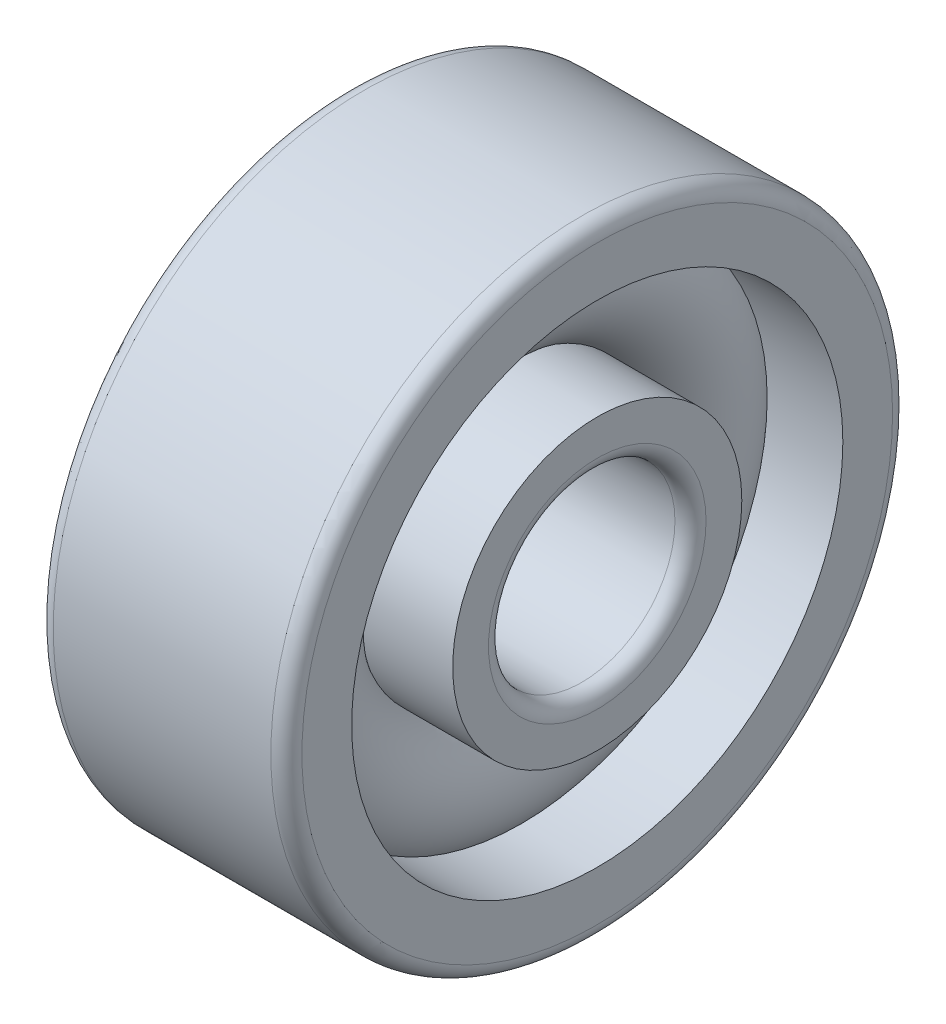
ISO-10303-21;
HEADER;
FILE_DESCRIPTION(('STEP AP214'),'2;1');
FILE_NAME('part.step','',(''),(''),'','','');
FILE_SCHEMA(('AUTOMOTIVE_DESIGN { 1 0 10303 214 1 1 1 1 }'));
ENDSEC;
DATA;
#1=APPLICATION_CONTEXT('core data for automotive mechanical design processes');
#2=APPLICATION_PROTOCOL_DEFINITION('international standard','automotive_design',2000,#1);
#3=PRODUCT_CONTEXT('',#1,'mechanical');
#4=PRODUCT('Part','Part','',(#3));
#5=PRODUCT_RELATED_PRODUCT_CATEGORY('part','',(#4));
#6=PRODUCT_DEFINITION_FORMATION('','',#4);
#7=PRODUCT_DEFINITION_CONTEXT('part definition',#1,'design');
#8=PRODUCT_DEFINITION('design','',#6,#7);
#9=PRODUCT_DEFINITION_SHAPE('','',#8);
#10=(LENGTH_UNIT() NAMED_UNIT(*) SI_UNIT(.MILLI.,.METRE.));
#11=(NAMED_UNIT(*) PLANE_ANGLE_UNIT() SI_UNIT($,.RADIAN.));
#12=(NAMED_UNIT(*) SI_UNIT($,.STERADIAN.) SOLID_ANGLE_UNIT());
#13=UNCERTAINTY_MEASURE_WITH_UNIT(LENGTH_MEASURE(1.E-05),#10,'distance_accuracy_value','');
#14=(GEOMETRIC_REPRESENTATION_CONTEXT(3) GLOBAL_UNCERTAINTY_ASSIGNED_CONTEXT((#13)) GLOBAL_UNIT_ASSIGNED_CONTEXT((#10,
#11,#12)) REPRESENTATION_CONTEXT('',''));
#15=CARTESIAN_POINT('',(0.,0.,0.));
#16=DIRECTION('',(0.,0.,1.));
#17=DIRECTION('',(1.,0.,0.));
#18=AXIS2_PLACEMENT_3D('',#15,#16,#17);
#19=CARTESIAN_POINT('',(0.,0.,0.));
#20=DIRECTION('',(-1.,0.,0.));
#21=DIRECTION('',(0.,0.,1.));
#22=AXIS2_PLACEMENT_3D('',#19,#20,#21);
#23=TOROIDAL_SURFACE('',#22,0.65,0.21);
#24=CARTESIAN_POINT('',(0.156524758424986,0.,0.));
#25=DIRECTION('',(-1.,0.,0.));
#26=DIRECTION('',(0.,0.,1.));
#27=AXIS2_PLACEMENT_3D('',#24,#25,#26);
#28=CIRCLE('',#27,0.79);
#29=CARTESIAN_POINT('',(0.156524758424986,0.,0.79));
#30=VERTEX_POINT('',#29);
#31=EDGE_CURVE('E35',#30,#30,#28,.F.);
#32=ORIENTED_EDGE('',*,*,#31,.T.);
#33=EDGE_LOOP('',(#32));
#34=FACE_BOUND('',#33,.T.);
#35=CARTESIAN_POINT('',(0.0993730345717593,0.,0.));
#36=DIRECTION('',(-1.,0.,0.));
#37=DIRECTION('',(0.,0.,1.));
#38=AXIS2_PLACEMENT_3D('',#35,#36,#37);
#39=CIRCLE('',#38,0.465000000000001);
#40=CARTESIAN_POINT('',(0.0993730345717593,0.,0.465000000000001));
#41=VERTEX_POINT('',#40);
#42=EDGE_CURVE('E10',#41,#41,#39,.T.);
#43=ORIENTED_EDGE('',*,*,#42,.T.);
#44=EDGE_LOOP('',(#43));
#45=FACE_BOUND('',#44,.T.);
#46=ADVANCED_FACE('F31',(#34,#45),#23,.T.);
#47=CARTESIAN_POINT('',(-20.6375,0.,0.));
#48=DIRECTION('',(1.,0.,0.));
#49=DIRECTION('',(0.,0.,-1.));
#50=AXIS2_PLACEMENT_3D('',#47,#48,#49);
#51=CYLINDRICAL_SURFACE('',#50,0.465000000000001);
#52=CARTESIAN_POINT('',(0.400000000000001,0.,0.));
#53=DIRECTION('',(1.,0.,0.));
#54=DIRECTION('',(0.,0.,-1.));
#55=AXIS2_PLACEMENT_3D('',#52,#53,#54);
#56=CIRCLE('',#55,0.465000000000001);
#57=CARTESIAN_POINT('',(0.400000000000001,0.,-0.465000000000001));
#58=VERTEX_POINT('',#57);
#59=EDGE_CURVE('E44',#58,#58,#56,.T.);
#60=ORIENTED_EDGE('',*,*,#59,.F.);
#61=EDGE_LOOP('',(#60));
#62=FACE_BOUND('',#61,.T.);
#63=ORIENTED_EDGE('',*,*,#42,.F.);
#64=EDGE_LOOP('',(#63));
#65=FACE_BOUND('',#64,.T.);
#66=ADVANCED_FACE('F83',(#62,#65),#51,.T.);
#67=CARTESIAN_POINT('',(-20.6375,0.,0.));
#68=DIRECTION('',(1.,0.,0.));
#69=DIRECTION('',(0.,0.,-1.));
#70=AXIS2_PLACEMENT_3D('',#67,#68,#69);
#71=CYLINDRICAL_SURFACE('',#70,0.51);
#72=CARTESIAN_POINT('',(-0.400000000000001,0.,0.));
#73=DIRECTION('',(1.,0.,0.));
#74=DIRECTION('',(0.,0.,-1.));
#75=AXIS2_PLACEMENT_3D('',#72,#73,#74);
#76=CIRCLE('',#75,0.51);
#77=CARTESIAN_POINT('',(-0.400000000000001,0.,-0.51));
#78=VERTEX_POINT('',#77);
#79=EDGE_CURVE('E53',#78,#78,#76,.T.);
#80=ORIENTED_EDGE('',*,*,#79,.T.);
#81=EDGE_LOOP('',(#80));
#82=FACE_BOUND('',#81,.T.);
#83=CARTESIAN_POINT('',(-0.156524758424985,0.,0.));
#84=DIRECTION('',(1.,0.,0.));
#85=DIRECTION('',(0.,0.,-1.));
#86=AXIS2_PLACEMENT_3D('',#83,#84,#85);
#87=CIRCLE('',#86,0.51);
#88=CARTESIAN_POINT('',(-0.156524758424985,0.,-0.51));
#89=VERTEX_POINT('',#88);
#90=EDGE_CURVE('E39',#89,#89,#87,.T.);
#91=ORIENTED_EDGE('',*,*,#90,.F.);
#92=EDGE_LOOP('',(#91));
#93=FACE_BOUND('',#92,.T.);
#94=ADVANCED_FACE('F86',(#82,#93),#71,.T.);
#95=CARTESIAN_POINT('',(0.400000000000001,0.35,0.));
#96=DIRECTION('',(1.,0.,0.));
#97=DIRECTION('',(0.,0.,-1.));
#98=AXIS2_PLACEMENT_3D('',#95,#96,#97);
#99=PLANE('',#98);
#100=ORIENTED_EDGE('',*,*,#59,.T.);
#101=EDGE_LOOP('',(#100));
#102=FACE_BOUND('',#101,.T.);
#103=CARTESIAN_POINT('',(0.400000000000001,0.,0.));
#104=DIRECTION('',(1.,0.,0.));
#105=DIRECTION('',(0.,0.,-1.));
#106=AXIS2_PLACEMENT_3D('',#103,#104,#105);
#107=CIRCLE('',#106,0.35);
#108=CARTESIAN_POINT('',(0.400000000000001,0.,-0.35));
#109=VERTEX_POINT('',#108);
#110=EDGE_CURVE('E75',#109,#109,#107,.T.);
#111=ORIENTED_EDGE('',*,*,#110,.F.);
#112=EDGE_LOOP('',(#111));
#113=FACE_BOUND('',#112,.T.);
#114=ADVANCED_FACE('F80',(#102,#113),#99,.T.);
#115=CARTESIAN_POINT('',(0.35,0.,0.));
#116=DIRECTION('',(1.,0.,0.));
#117=DIRECTION('',(0.,0.,-1.));
#118=AXIS2_PLACEMENT_3D('',#115,#116,#117);
#119=TOROIDAL_SURFACE('',#118,0.35,0.0500000000000001);
#120=ORIENTED_EDGE('',*,*,#110,.T.);
#121=EDGE_LOOP('',(#120));
#122=FACE_BOUND('',#121,.T.);
#123=CARTESIAN_POINT('',(0.35,0.,0.));
#124=DIRECTION('',(1.,0.,0.));
#125=DIRECTION('',(0.,0.,-1.));
#126=AXIS2_PLACEMENT_3D('',#123,#124,#125);
#127=CIRCLE('',#126,0.3);
#128=CARTESIAN_POINT('',(0.35,0.,-0.3));
#129=VERTEX_POINT('',#128);
#130=EDGE_CURVE('E72',#129,#129,#127,.T.);
#131=ORIENTED_EDGE('',*,*,#130,.F.);
#132=EDGE_LOOP('',(#131));
#133=FACE_BOUND('',#132,.T.);
#134=ADVANCED_FACE('F97',(#122,#133),#119,.T.);
#135=CARTESIAN_POINT('',(-20.6375,0.,0.));
#136=DIRECTION('',(1.,0.,0.));
#137=DIRECTION('',(0.,0.,-1.));
#138=AXIS2_PLACEMENT_3D('',#135,#136,#137);
#139=CYLINDRICAL_SURFACE('',#138,0.3);
#140=ORIENTED_EDGE('',*,*,#130,.T.);
#141=EDGE_LOOP('',(#140));
#142=FACE_BOUND('',#141,.T.);
#143=CARTESIAN_POINT('',(-0.35,0.,0.));
#144=DIRECTION('',(1.,0.,0.));
#145=DIRECTION('',(0.,0.,-1.));
#146=AXIS2_PLACEMENT_3D('',#143,#144,#145);
#147=CIRCLE('',#146,0.3);
#148=CARTESIAN_POINT('',(-0.35,0.,-0.3));
#149=VERTEX_POINT('',#148);
#150=EDGE_CURVE('E69',#149,#149,#147,.T.);
#151=ORIENTED_EDGE('',*,*,#150,.F.);
#152=EDGE_LOOP('',(#151));
#153=FACE_BOUND('',#152,.T.);
#154=ADVANCED_FACE('F100',(#142,#153),#139,.F.);
#155=CARTESIAN_POINT('',(-0.35,0.,0.));
#156=DIRECTION('',(1.,0.,0.));
#157=DIRECTION('',(0.,0.,-1.));
#158=AXIS2_PLACEMENT_3D('',#155,#156,#157);
#159=TOROIDAL_SURFACE('',#158,0.35,0.0500000000000001);
#160=ORIENTED_EDGE('',*,*,#150,.T.);
#161=EDGE_LOOP('',(#160));
#162=FACE_BOUND('',#161,.T.);
#163=CARTESIAN_POINT('',(-0.400000000000001,0.,0.));
#164=DIRECTION('',(1.,0.,0.));
#165=DIRECTION('',(0.,0.,-1.));
#166=AXIS2_PLACEMENT_3D('',#163,#164,#165);
#167=CIRCLE('',#166,0.35);
#168=CARTESIAN_POINT('',(-0.400000000000001,0.,-0.35));
#169=VERTEX_POINT('',#168);
#170=EDGE_CURVE('E66',#169,#169,#167,.T.);
#171=ORIENTED_EDGE('',*,*,#170,.F.);
#172=EDGE_LOOP('',(#171));
#173=FACE_BOUND('',#172,.T.);
#174=ADVANCED_FACE('F104',(#162,#173),#159,.T.);
#175=CARTESIAN_POINT('',(-0.4,0.51,0.));
#176=DIRECTION('',(-1.,0.,0.));
#177=DIRECTION('',(0.,0.,1.));
#178=AXIS2_PLACEMENT_3D('',#175,#176,#177);
#179=PLANE('',#178);
#180=ORIENTED_EDGE('',*,*,#170,.T.);
#181=EDGE_LOOP('',(#180));
#182=FACE_BOUND('',#181,.T.);
#183=ORIENTED_EDGE('',*,*,#79,.F.);
#184=EDGE_LOOP('',(#183));
#185=FACE_BOUND('',#184,.T.);
#186=ADVANCED_FACE('F108',(#182,#185),#179,.T.);
#187=CARTESIAN_POINT('',(-0.0993730345717585,0.,0.));
#188=DIRECTION('',(1.,0.,0.));
#189=DIRECTION('',(0.,0.,-1.));
#190=AXIS2_PLACEMENT_3D('',#187,#188,#189);
#191=CIRCLE('',#190,0.835000000000001);
#192=CARTESIAN_POINT('',(-0.0993730345717585,0.,-0.835000000000001));
#193=VERTEX_POINT('',#192);
#194=EDGE_CURVE('E47',#193,#193,#191,.F.);
#195=ORIENTED_EDGE('',*,*,#194,.T.);
#196=EDGE_LOOP('',(#195));
#197=FACE_BOUND('',#196,.T.);
#198=ORIENTED_EDGE('',*,*,#90,.T.);
#199=EDGE_LOOP('',(#198));
#200=FACE_BOUND('',#199,.T.);
#201=ADVANCED_FACE('F33',(#197,#200),#23,.T.);
#202=CARTESIAN_POINT('',(-20.6375,0.,0.));
#203=DIRECTION('',(1.,0.,0.));
#204=DIRECTION('',(0.,0.,-1.));
#205=AXIS2_PLACEMENT_3D('',#202,#203,#204);
#206=CYLINDRICAL_SURFACE('',#205,0.79);
#207=CARTESIAN_POINT('',(0.400000000000001,0.,0.));
#208=DIRECTION('',(1.,0.,0.));
#209=DIRECTION('',(0.,0.,-1.));
#210=AXIS2_PLACEMENT_3D('',#207,#208,#209);
#211=CIRCLE('',#210,0.79);
#212=CARTESIAN_POINT('',(0.400000000000001,0.,-0.79));
#213=VERTEX_POINT('',#212);
#214=EDGE_CURVE('E149',#213,#213,#211,.T.);
#215=ORIENTED_EDGE('',*,*,#214,.T.);
#216=EDGE_LOOP('',(#215));
#217=FACE_BOUND('',#216,.T.);
#218=ORIENTED_EDGE('',*,*,#31,.F.);
#219=EDGE_LOOP('',(#218));
#220=FACE_BOUND('',#219,.T.);
#221=ADVANCED_FACE('F130',(#217,#220),#206,.F.);
#222=CARTESIAN_POINT('',(-20.6375,0.,0.));
#223=DIRECTION('',(1.,0.,0.));
#224=DIRECTION('',(0.,0.,-1.));
#225=AXIS2_PLACEMENT_3D('',#222,#223,#224);
#226=CYLINDRICAL_SURFACE('',#225,0.835000000000001);
#227=CARTESIAN_POINT('',(-0.400000000000001,0.,0.));
#228=DIRECTION('',(1.,0.,0.));
#229=DIRECTION('',(0.,0.,-1.));
#230=AXIS2_PLACEMENT_3D('',#227,#228,#229);
#231=CIRCLE('',#230,0.835000000000001);
#232=CARTESIAN_POINT('',(-0.400000000000001,0.,-0.835000000000001));
#233=VERTEX_POINT('',#232);
#234=EDGE_CURVE('E144',#233,#233,#231,.T.);
#235=ORIENTED_EDGE('',*,*,#234,.F.);
#236=EDGE_LOOP('',(#235));
#237=FACE_BOUND('',#236,.T.);
#238=ORIENTED_EDGE('',*,*,#194,.F.);
#239=EDGE_LOOP('',(#238));
#240=FACE_BOUND('',#239,.T.);
#241=ADVANCED_FACE('F117',(#237,#240),#226,.F.);
#242=CARTESIAN_POINT('',(-0.350000000000001,0.,0.));
#243=DIRECTION('',(1.,0.,0.));
#244=DIRECTION('',(0.,0.,-1.));
#245=AXIS2_PLACEMENT_3D('',#242,#243,#244);
#246=TOROIDAL_SURFACE('',#245,0.95,0.0499999999999998);
#247=CARTESIAN_POINT('',(-0.400000000000001,0.,0.));
#248=DIRECTION('',(1.,0.,0.));
#249=DIRECTION('',(0.,0.,-1.));
#250=AXIS2_PLACEMENT_3D('',#247,#248,#249);
#251=CIRCLE('',#250,0.95);
#252=CARTESIAN_POINT('',(-0.400000000000001,0.,-0.95));
#253=VERTEX_POINT('',#252);
#254=EDGE_CURVE('E147',#253,#253,#251,.T.);
#255=ORIENTED_EDGE('',*,*,#254,.T.);
#256=EDGE_LOOP('',(#255));
#257=FACE_BOUND('',#256,.T.);
#258=CARTESIAN_POINT('',(-0.35,0.,0.));
#259=DIRECTION('',(1.,0.,0.));
#260=DIRECTION('',(0.,0.,-1.));
#261=AXIS2_PLACEMENT_3D('',#258,#259,#260);
#262=CIRCLE('',#261,1.);
#263=CARTESIAN_POINT('',(-0.35,0.,-1.));
#264=VERTEX_POINT('',#263);
#265=EDGE_CURVE('E49',#264,#264,#262,.T.);
#266=ORIENTED_EDGE('',*,*,#265,.F.);
#267=EDGE_LOOP('',(#266));
#268=FACE_BOUND('',#267,.T.);
#269=ADVANCED_FACE('F113',(#257,#268),#246,.T.);
#270=CARTESIAN_POINT('',(-20.6375,0.,0.));
#271=DIRECTION('',(1.,0.,0.));
#272=DIRECTION('',(0.,0.,-1.));
#273=AXIS2_PLACEMENT_3D('',#270,#271,#272);
#274=CYLINDRICAL_SURFACE('',#273,1.);
#275=ORIENTED_EDGE('',*,*,#265,.T.);
#276=EDGE_LOOP('',(#275));
#277=FACE_BOUND('',#276,.T.);
#278=CARTESIAN_POINT('',(0.35,0.,0.));
#279=DIRECTION('',(1.,0.,0.));
#280=DIRECTION('',(0.,0.,-1.));
#281=AXIS2_PLACEMENT_3D('',#278,#279,#280);
#282=CIRCLE('',#281,1.);
#283=CARTESIAN_POINT('',(0.35,0.,-1.));
#284=VERTEX_POINT('',#283);
#285=EDGE_CURVE('E55',#284,#284,#282,.T.);
#286=ORIENTED_EDGE('',*,*,#285,.F.);
#287=EDGE_LOOP('',(#286));
#288=FACE_BOUND('',#287,.T.);
#289=ADVANCED_FACE('F116',(#277,#288),#274,.T.);
#290=CARTESIAN_POINT('',(0.350000000000001,0.,0.));
#291=DIRECTION('',(1.,0.,0.));
#292=DIRECTION('',(0.,0.,-1.));
#293=AXIS2_PLACEMENT_3D('',#290,#291,#292);
#294=TOROIDAL_SURFACE('',#293,0.95,0.0499999999999998);
#295=ORIENTED_EDGE('',*,*,#285,.T.);
#296=EDGE_LOOP('',(#295));
#297=FACE_BOUND('',#296,.T.);
#298=CARTESIAN_POINT('',(0.400000000000001,0.,0.));
#299=DIRECTION('',(1.,0.,0.));
#300=DIRECTION('',(0.,0.,-1.));
#301=AXIS2_PLACEMENT_3D('',#298,#299,#300);
#302=CIRCLE('',#301,0.95);
#303=CARTESIAN_POINT('',(0.400000000000001,0.,-0.95));
#304=VERTEX_POINT('',#303);
#305=EDGE_CURVE('E60',#304,#304,#302,.T.);
#306=ORIENTED_EDGE('',*,*,#305,.F.);
#307=EDGE_LOOP('',(#306));
#308=FACE_BOUND('',#307,.T.);
#309=ADVANCED_FACE('F121',(#297,#308),#294,.T.);
#310=CARTESIAN_POINT('',(0.400000000000001,0.95,0.));
#311=DIRECTION('',(1.,0.,0.));
#312=DIRECTION('',(0.,0.,-1.));
#313=AXIS2_PLACEMENT_3D('',#310,#311,#312);
#314=PLANE('',#313);
#315=ORIENTED_EDGE('',*,*,#305,.T.);
#316=EDGE_LOOP('',(#315));
#317=FACE_BOUND('',#316,.T.);
#318=ORIENTED_EDGE('',*,*,#214,.F.);
#319=EDGE_LOOP('',(#318));
#320=FACE_BOUND('',#319,.T.);
#321=ADVANCED_FACE('F124',(#317,#320),#314,.T.);
#322=CARTESIAN_POINT('',(-0.400000000000001,0.835000000000001,0.));
#323=DIRECTION('',(-1.,0.,0.));
#324=DIRECTION('',(0.,0.,1.));
#325=AXIS2_PLACEMENT_3D('',#322,#323,#324);
#326=PLANE('',#325);
#327=ORIENTED_EDGE('',*,*,#234,.T.);
#328=EDGE_LOOP('',(#327));
#329=FACE_BOUND('',#328,.T.);
#330=ORIENTED_EDGE('',*,*,#254,.F.);
#331=EDGE_LOOP('',(#330));
#332=FACE_BOUND('',#331,.T.);
#333=ADVANCED_FACE('F128',(#329,#332),#326,.T.);
#334=CLOSED_SHELL('',(#46,#66,#94,#114,#134,#154,#174,#186,#201,#221,#241,#269,#289,#309,#321,#333));
#335=MANIFOLD_SOLID_BREP('B2',#334);
#336=ADVANCED_BREP_SHAPE_REPRESENTATION('',(#18,#335),#14);
#337=SHAPE_DEFINITION_REPRESENTATION(#9,#336);
ENDSEC;
END-ISO-10303-21;
